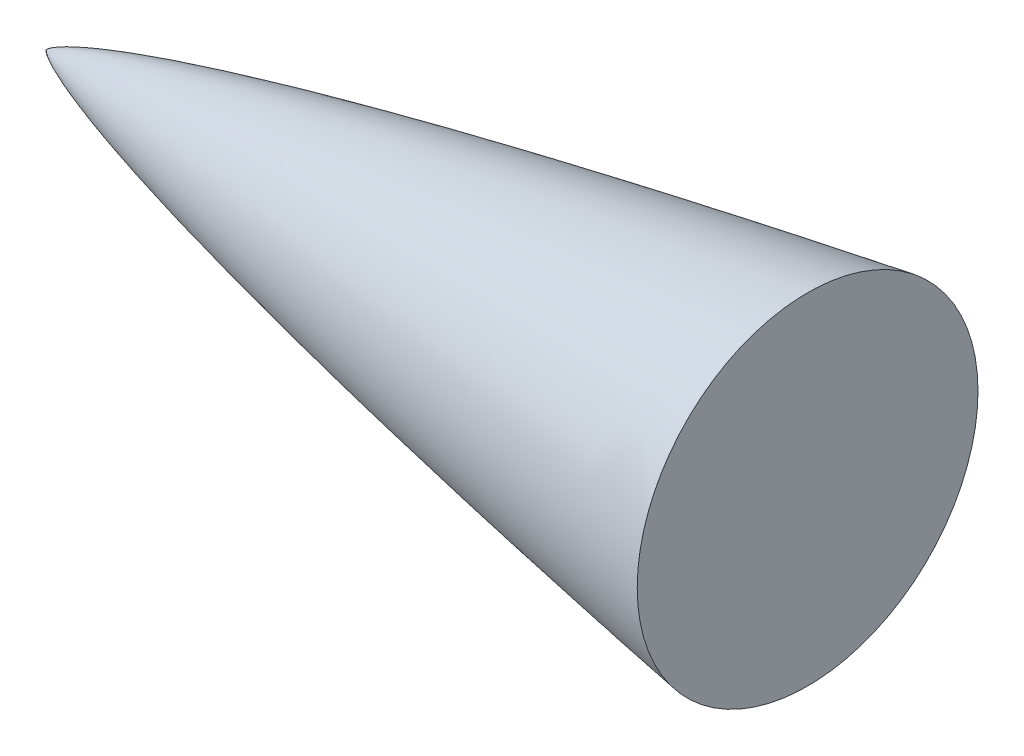
ISO-10303-21;
HEADER;
FILE_DESCRIPTION(('STEP AP214'),'2;1');
FILE_NAME('part.step','',(''),(''),'','','');
FILE_SCHEMA(('AUTOMOTIVE_DESIGN { 1 0 10303 214 1 1 1 1 }'));
ENDSEC;
DATA;
#1=APPLICATION_CONTEXT('core data for automotive mechanical design processes');
#2=APPLICATION_PROTOCOL_DEFINITION('international standard','automotive_design',2000,#1);
#3=PRODUCT_CONTEXT('',#1,'mechanical');
#4=PRODUCT('Part','Part','',(#3));
#5=PRODUCT_RELATED_PRODUCT_CATEGORY('part','',(#4));
#6=PRODUCT_DEFINITION_FORMATION('','',#4);
#7=PRODUCT_DEFINITION_CONTEXT('part definition',#1,'design');
#8=PRODUCT_DEFINITION('design','',#6,#7);
#9=PRODUCT_DEFINITION_SHAPE('','',#8);
#10=(LENGTH_UNIT() NAMED_UNIT(*) SI_UNIT(.MILLI.,.METRE.));
#11=(NAMED_UNIT(*) PLANE_ANGLE_UNIT() SI_UNIT($,.RADIAN.));
#12=(NAMED_UNIT(*) SI_UNIT($,.STERADIAN.) SOLID_ANGLE_UNIT());
#13=UNCERTAINTY_MEASURE_WITH_UNIT(LENGTH_MEASURE(1.E-05),#10,'distance_accuracy_value','');
#14=(GEOMETRIC_REPRESENTATION_CONTEXT(3) GLOBAL_UNCERTAINTY_ASSIGNED_CONTEXT((#13)) GLOBAL_UNIT_ASSIGNED_CONTEXT((#10,
#11,#12)) REPRESENTATION_CONTEXT('',''));
#15=CARTESIAN_POINT('',(0.,0.,0.));
#16=DIRECTION('',(0.,0.,1.));
#17=DIRECTION('',(1.,0.,0.));
#18=AXIS2_PLACEMENT_3D('',#15,#16,#17);
#19=CARTESIAN_POINT('',(635.,0.,-65.405));
#20=CARTESIAN_POINT('',(632.980968041379,0.,-65.3999049079982));
#21=CARTESIAN_POINT('',(628.94305151866,0.,-65.3607987649683));
#22=CARTESIAN_POINT('',(620.867800743746,0.,-65.2384258351577));
#23=CARTESIAN_POINT('',(607.876612197189,0.,-64.9420444267637));
#24=CARTESIAN_POINT('',(591.989866173893,0.,-64.4665825864282));
#25=CARTESIAN_POINT('',(568.294487812522,0.,-63.5924578117391));
#26=CARTESIAN_POINT('',(538.814064527871,0.,-62.2664605978091));
#27=CARTESIAN_POINT('',(504.434100625344,0.,-60.4361863708922));
#28=CARTESIAN_POINT('',(465.161890456535,0.,-58.0127528854531));
#29=CARTESIAN_POINT('',(425.9093857375,0.,-55.2895252497302));
#30=CARTESIAN_POINT('',(386.677550901075,0.,-52.2836135264071));
#31=CARTESIAN_POINT('',(347.467762428279,0.,-49.0025673324939));
#32=CARTESIAN_POINT('',(308.282068325666,0.,-45.4454012222469));
#33=CARTESIAN_POINT('',(269.123174714224,0.,-41.603760555562));
#34=CARTESIAN_POINT('',(229.995170684783,0.,-37.4592339547087));
#35=CARTESIAN_POINT('',(190.903568878781,0.,-32.9826992551562));
#36=CARTESIAN_POINT('',(151.85753033752,0.,-28.1241973222402));
#37=CARTESIAN_POINT('',(112.870807325212,0.,-22.8061369351956));
#38=CARTESIAN_POINT('',(77.9573287846347,0.,-17.4873019784258));
#39=CARTESIAN_POINT('',(49.1787935546811,0.,-12.5135793040534));
#40=CARTESIAN_POINT('',(28.2617417770004,0.,-8.30499279351693));
#41=CARTESIAN_POINT('',(16.0220282949451,0.,-5.4462502005679));
#42=CARTESIAN_POINT('',(8.93318062814785,0.,-3.51548578780448));
#43=CARTESIAN_POINT('',(5.16339541485644,0.,-2.32840347516784));
#44=CARTESIAN_POINT('',(3.11582679923172,0.,-1.59218900684346));
#45=CARTESIAN_POINT('',(1.97027691704132,0.,-1.1275016191836));
#46=CARTESIAN_POINT('',(1.33181141167438,0.,-0.839140676757943));
#47=CARTESIAN_POINT('',(0.956716029049676,0.,-0.653660621097923));
#48=CARTESIAN_POINT('',(0.715531562152649,0.,-0.52514659793293));
#49=CARTESIAN_POINT('',(0.55021043149539,0.,-0.431764809009291));
#50=CARTESIAN_POINT('',(0.406270251751106,0.,-0.344359984283255));
#51=CARTESIAN_POINT('',(0.283649615611115,0.,-0.263361482710001));
#52=CARTESIAN_POINT('',(0.181602895816813,0.,-0.188889432865866));
#53=CARTESIAN_POINT('',(0.109817079168351,0.,-0.130424863371351));
#54=CARTESIAN_POINT('',(0.0569836765196285,0.,-0.0804262546774959));
#55=CARTESIAN_POINT('',(0.0222716682134472,0.,-0.0403845586316731));
#56=CARTESIAN_POINT('',(0.00752296936523678,0.,-0.0183675987536769));
#57=CARTESIAN_POINT('',(0.00219211488350357,0.,-0.00629020802223046));
#58=CARTESIAN_POINT('',(0.,0.,0.));
#59=B_SPLINE_CURVE_WITH_KNOTS('',4,(#19,#20,#21,#22,#23,#24,#25,#26,#27,#28,#29,#30,#31,#32,#33,
#34,#35,#36,#37,#38,#39,#40,#41,#42,#43,#44,#45,#46,#47,#48,#49,#50,#51,#52,#53,#54,#55,#56,#57,
#58),.UNSPECIFIED.,.F.,.F.,(5,1,1,1,1,1,1,1,1,1,1,1,1,1,1,1,1,1,1,1,1,1,1,1,1,1,1,1,1,1,1,1,1,1,
1,1,5),(0.,0.0126278600836156,0.0252557201672313,0.0505114403344626,0.0812725997628029,
0.112033759191143,0.173556078208551,0.235078396298971,0.296600715210933,0.358123034494871,
0.419645352372099,0.481167670690979,0.542689989321029,0.604212308113024,0.665734626856386,
0.727256945203041,0.788779262537685,0.850301578000527,0.911823895791277,0.948128969524394,
0.971421118017023,0.983729988096585,0.990421707276453,0.994070390445943,0.996134035175531,
0.997335608030765,0.998151497389768,0.998451073952135,0.998750650514502,0.999044750264593,
0.999338850014684,0.999504137511013,0.999669425007342,0.999834712503671,0.999917356251836,
0.999958678125918,1.),.UNSPECIFIED.);
#60=CARTESIAN_POINT('',(0.,0.,0.));
#61=DIRECTION('',(-1.,0.,0.));
#62=AXIS1_PLACEMENT('',#60,#61);
#63=SURFACE_OF_REVOLUTION('',#59,#62);
#64=CARTESIAN_POINT('',(0.,0.,0.));
#65=VERTEX_POINT('',#64);
#66=VERTEX_LOOP('',#65);
#67=FACE_BOUND('',#66,.T.);
#68=CARTESIAN_POINT('',(76.2,0.,0.));
#69=DIRECTION('',(-1.,0.,0.));
#70=DIRECTION('',(0.,0.,1.));
#71=AXIS2_PLACEMENT_3D('',#68,#69,#70);
#72=CIRCLE('',#71,17.0521841131544);
#73=CARTESIAN_POINT('',(76.2,0.,17.0521841131544));
#74=VERTEX_POINT('',#73);
#75=EDGE_CURVE('E11',#74,#74,#72,.F.);
#76=ORIENTED_EDGE('',*,*,#75,.F.);
#77=EDGE_LOOP('',(#76));
#78=FACE_BOUND('',#77,.T.);
#79=ADVANCED_FACE('F37',(#67,#78),#63,.T.);
#80=CARTESIAN_POINT('',(76.2,88.9,133.858));
#81=DIRECTION('',(1.,0.,0.));
#82=DIRECTION('',(0.,0.,-1.));
#83=AXIS2_PLACEMENT_3D('',#80,#81,#82);
#84=PLANE('',#83);
#85=ORIENTED_EDGE('',*,*,#75,.T.);
#86=EDGE_LOOP('',(#85));
#87=FACE_BOUND('',#86,.T.);
#88=ADVANCED_FACE('F47',(#87),#84,.T.);
#89=CLOSED_SHELL('',(#79,#88));
#90=MANIFOLD_SOLID_BREP('B2',#89);
#91=ADVANCED_BREP_SHAPE_REPRESENTATION('',(#18,#90),#14);
#92=SHAPE_DEFINITION_REPRESENTATION(#9,#91);
ENDSEC;
END-ISO-10303-21;
